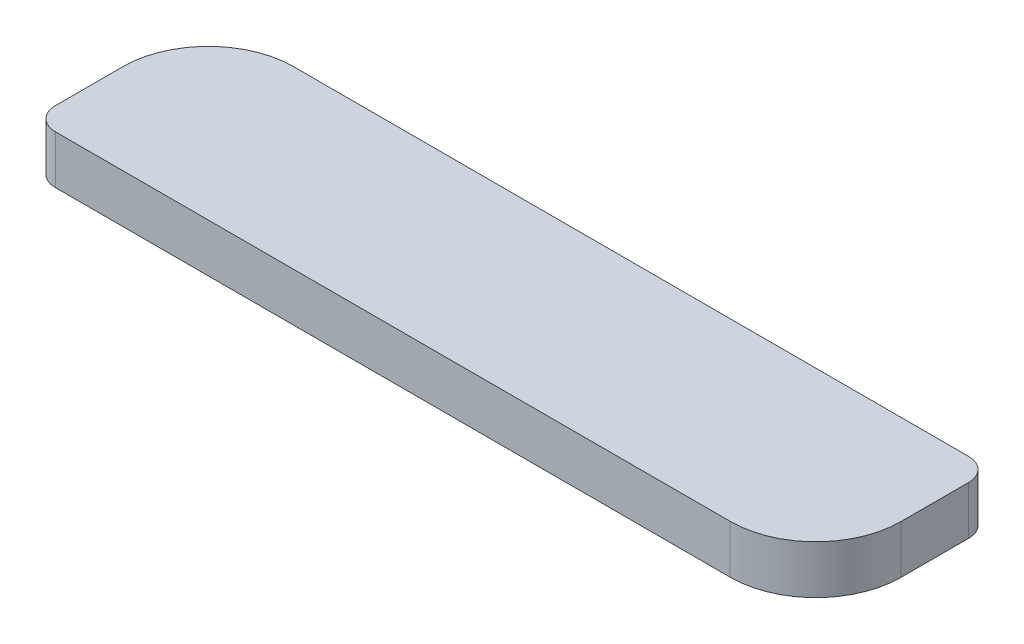
ISO-10303-21;
HEADER;
FILE_DESCRIPTION(('STEP AP214'),'2;1');
FILE_NAME('part.step','',(''),(''),'','','');
FILE_SCHEMA(('AUTOMOTIVE_DESIGN { 1 0 10303 214 1 1 1 1 }'));
ENDSEC;
DATA;
#1=APPLICATION_CONTEXT('core data for automotive mechanical design processes');
#2=APPLICATION_PROTOCOL_DEFINITION('international standard','automotive_design',2000,#1);
#3=PRODUCT_CONTEXT('',#1,'mechanical');
#4=PRODUCT('Part','Part','',(#3));
#5=PRODUCT_RELATED_PRODUCT_CATEGORY('part','',(#4));
#6=PRODUCT_DEFINITION_FORMATION('','',#4);
#7=PRODUCT_DEFINITION_CONTEXT('part definition',#1,'design');
#8=PRODUCT_DEFINITION('design','',#6,#7);
#9=PRODUCT_DEFINITION_SHAPE('','',#8);
#10=(LENGTH_UNIT() NAMED_UNIT(*) SI_UNIT(.MILLI.,.METRE.));
#11=(NAMED_UNIT(*) PLANE_ANGLE_UNIT() SI_UNIT($,.RADIAN.));
#12=(NAMED_UNIT(*) SI_UNIT($,.STERADIAN.) SOLID_ANGLE_UNIT());
#13=UNCERTAINTY_MEASURE_WITH_UNIT(LENGTH_MEASURE(1.E-05),#10,'distance_accuracy_value','');
#14=(GEOMETRIC_REPRESENTATION_CONTEXT(3) GLOBAL_UNCERTAINTY_ASSIGNED_CONTEXT((#13)) GLOBAL_UNIT_ASSIGNED_CONTEXT((#10,
#11,#12)) REPRESENTATION_CONTEXT('',''));
#15=CARTESIAN_POINT('',(0.,0.,0.));
#16=DIRECTION('',(0.,0.,1.));
#17=DIRECTION('',(1.,0.,0.));
#18=AXIS2_PLACEMENT_3D('',#15,#16,#17);
#19=CARTESIAN_POINT('',(0.,0.,-10.));
#20=DIRECTION('',(0.,-1.,0.));
#21=DIRECTION('',(0.,0.,-1.));
#22=AXIS2_PLACEMENT_3D('',#19,#20,#21);
#23=PLANE('',#22);
#24=CARTESIAN_POINT('',(28.,0.,-40.));
#25=DIRECTION('',(0.,1.,0.));
#26=DIRECTION('',(0.,0.,1.));
#27=AXIS2_PLACEMENT_3D('',#24,#25,#26);
#28=CIRCLE('',#27,38.);
#29=CARTESIAN_POINT('',(28.,0.,-78.));
#30=VERTEX_POINT('',#29);
#31=CARTESIAN_POINT('',(-10.,0.,-40.));
#32=VERTEX_POINT('',#31);
#33=EDGE_CURVE('E278',#30,#32,#28,.T.);
#34=ORIENTED_EDGE('',*,*,#33,.F.);
#35=DIRECTION('',(0.,0.,1.));
#36=VECTOR('',#35,1.);
#37=CARTESIAN_POINT('',(28.,0.,-78.));
#38=LINE('',#37,#36);
#39=CARTESIAN_POINT('',(28.,0.,-42.));
#40=VERTEX_POINT('',#39);
#41=EDGE_CURVE('E55',#30,#40,#38,.T.);
#42=ORIENTED_EDGE('',*,*,#41,.T.);
#43=DIRECTION('',(-1.,0.,0.));
#44=VECTOR('',#43,1.);
#45=CARTESIAN_POINT('',(294.,0.,-42.));
#46=LINE('',#45,#44);
#47=CARTESIAN_POINT('',(294.,0.,-42.));
#48=VERTEX_POINT('',#47);
#49=EDGE_CURVE('E148',#48,#40,#46,.T.);
#50=ORIENTED_EDGE('',*,*,#49,.F.);
#51=DIRECTION('',(0.,0.,1.));
#52=VECTOR('',#51,1.);
#53=CARTESIAN_POINT('',(294.,0.,-78.));
#54=LINE('',#53,#52);
#55=CARTESIAN_POINT('',(294.,0.,-78.));
#56=VERTEX_POINT('',#55);
#57=EDGE_CURVE('E61',#56,#48,#54,.T.);
#58=ORIENTED_EDGE('',*,*,#57,.F.);
#59=DIRECTION('',(-1.,0.,0.));
#60=VECTOR('',#59,1.);
#61=CARTESIAN_POINT('',(328.,0.,-78.));
#62=LINE('',#61,#60);
#63=CARTESIAN_POINT('',(328.,0.,-78.));
#64=VERTEX_POINT('',#63);
#65=EDGE_CURVE('E275',#64,#56,#62,.T.);
#66=ORIENTED_EDGE('',*,*,#65,.F.);
#67=CARTESIAN_POINT('',(328.,0.,-68.));
#68=DIRECTION('',(0.,1.,0.));
#69=DIRECTION('',(0.,0.,1.));
#70=AXIS2_PLACEMENT_3D('',#67,#68,#69);
#71=CIRCLE('',#70,10.);
#72=CARTESIAN_POINT('',(338.,0.,-68.));
#73=VERTEX_POINT('',#72);
#74=EDGE_CURVE('E272',#73,#64,#71,.T.);
#75=ORIENTED_EDGE('',*,*,#74,.F.);
#76=DIRECTION('',(0.,0.,-1.));
#77=VECTOR('',#76,1.);
#78=CARTESIAN_POINT('',(338.,0.,-38.));
#79=LINE('',#78,#77);
#80=CARTESIAN_POINT('',(338.,0.,-38.));
#81=VERTEX_POINT('',#80);
#82=EDGE_CURVE('E269',#81,#73,#79,.T.);
#83=ORIENTED_EDGE('',*,*,#82,.F.);
#84=CARTESIAN_POINT('',(300.,0.,-38.));
#85=DIRECTION('',(0.,1.,0.));
#86=DIRECTION('',(0.,0.,1.));
#87=AXIS2_PLACEMENT_3D('',#84,#85,#86);
#88=CIRCLE('',#87,38.);
#89=CARTESIAN_POINT('',(300.,0.,0.));
#90=VERTEX_POINT('',#89);
#91=EDGE_CURVE('E266',#90,#81,#88,.T.);
#92=ORIENTED_EDGE('',*,*,#91,.F.);
#93=DIRECTION('',(1.,0.,0.));
#94=VECTOR('',#93,1.);
#95=CARTESIAN_POINT('',(0.,0.,0.));
#96=LINE('',#95,#94);
#97=CARTESIAN_POINT('',(0.,0.,0.));
#98=VERTEX_POINT('',#97);
#99=EDGE_CURVE('E263',#98,#90,#96,.T.);
#100=ORIENTED_EDGE('',*,*,#99,.F.);
#101=CARTESIAN_POINT('',(0.,0.,-10.));
#102=DIRECTION('',(0.,1.,0.));
#103=DIRECTION('',(0.,0.,-1.));
#104=AXIS2_PLACEMENT_3D('',#101,#102,#103);
#105=CIRCLE('',#104,10.);
#106=CARTESIAN_POINT('',(-10.,0.,-10.));
#107=VERTEX_POINT('',#106);
#108=EDGE_CURVE('E153',#107,#98,#105,.T.);
#109=ORIENTED_EDGE('',*,*,#108,.F.);
#110=DIRECTION('',(0.,0.,1.));
#111=VECTOR('',#110,1.);
#112=CARTESIAN_POINT('',(-10.,0.,-40.));
#113=LINE('',#112,#111);
#114=EDGE_CURVE('E238',#32,#107,#113,.T.);
#115=ORIENTED_EDGE('',*,*,#114,.F.);
#116=EDGE_LOOP('',(#34,#42,#50,#58,#66,#75,#83,#92,#100,#109,#115));
#117=FACE_BOUND('',#116,.T.);
#118=ADVANCED_FACE('F39',(#117),#23,.T.);
#119=CARTESIAN_POINT('',(0.,21.5,-10.));
#120=DIRECTION('',(0.,-1.,0.));
#121=DIRECTION('',(0.,0.,-1.));
#122=AXIS2_PLACEMENT_3D('',#119,#120,#121);
#123=CYLINDRICAL_SURFACE('',#122,10.);
#124=ORIENTED_EDGE('',*,*,#108,.T.);
#125=DIRECTION('',(0.,-1.,0.));
#126=VECTOR('',#125,1.);
#127=CARTESIAN_POINT('',(0.,21.5,0.));
#128=LINE('',#127,#126);
#129=CARTESIAN_POINT('',(0.,21.5,0.));
#130=VERTEX_POINT('',#129);
#131=EDGE_CURVE('E11',#130,#98,#128,.T.);
#132=ORIENTED_EDGE('',*,*,#131,.F.);
#133=CARTESIAN_POINT('',(0.,21.5,-10.));
#134=DIRECTION('',(0.,1.,0.));
#135=DIRECTION('',(0.,0.,-1.));
#136=AXIS2_PLACEMENT_3D('',#133,#134,#135);
#137=CIRCLE('',#136,10.);
#138=CARTESIAN_POINT('',(-10.,21.5,-10.));
#139=VERTEX_POINT('',#138);
#140=EDGE_CURVE('E233',#139,#130,#137,.T.);
#141=ORIENTED_EDGE('',*,*,#140,.F.);
#142=DIRECTION('',(0.,-1.,0.));
#143=VECTOR('',#142,1.);
#144=CARTESIAN_POINT('',(-10.,21.5,-10.));
#145=LINE('',#144,#143);
#146=EDGE_CURVE('E259',#139,#107,#145,.T.);
#147=ORIENTED_EDGE('',*,*,#146,.T.);
#148=EDGE_LOOP('',(#124,#132,#141,#147));
#149=FACE_BOUND('',#148,.T.);
#150=ADVANCED_FACE('F41',(#149),#123,.T.);
#151=CARTESIAN_POINT('',(0.,21.5,0.));
#152=DIRECTION('',(0.,0.,-1.));
#153=DIRECTION('',(-1.,0.,0.));
#154=AXIS2_PLACEMENT_3D('',#151,#152,#153);
#155=PLANE('',#154);
#156=ORIENTED_EDGE('',*,*,#99,.T.);
#157=DIRECTION('',(0.,-1.,0.));
#158=VECTOR('',#157,1.);
#159=CARTESIAN_POINT('',(300.,21.5,0.));
#160=LINE('',#159,#158);
#161=CARTESIAN_POINT('',(300.,21.5,0.));
#162=VERTEX_POINT('',#161);
#163=EDGE_CURVE('E48',#162,#90,#160,.T.);
#164=ORIENTED_EDGE('',*,*,#163,.F.);
#165=DIRECTION('',(1.,0.,0.));
#166=VECTOR('',#165,1.);
#167=CARTESIAN_POINT('',(0.,21.5,0.));
#168=LINE('',#167,#166);
#169=EDGE_CURVE('E237',#130,#162,#168,.T.);
#170=ORIENTED_EDGE('',*,*,#169,.F.);
#171=ORIENTED_EDGE('',*,*,#131,.T.);
#172=EDGE_LOOP('',(#156,#164,#170,#171));
#173=FACE_BOUND('',#172,.T.);
#174=ADVANCED_FACE('F330',(#173),#155,.F.);
#175=CARTESIAN_POINT('',(300.,21.5,-38.));
#176=DIRECTION('',(0.,-1.,0.));
#177=DIRECTION('',(0.,0.,-1.));
#178=AXIS2_PLACEMENT_3D('',#175,#176,#177);
#179=CYLINDRICAL_SURFACE('',#178,38.);
#180=ORIENTED_EDGE('',*,*,#91,.T.);
#181=DIRECTION('',(0.,-1.,0.));
#182=VECTOR('',#181,1.);
#183=CARTESIAN_POINT('',(338.,21.5,-38.));
#184=LINE('',#183,#182);
#185=CARTESIAN_POINT('',(338.,21.5,-38.));
#186=VERTEX_POINT('',#185);
#187=EDGE_CURVE('E301',#186,#81,#184,.T.);
#188=ORIENTED_EDGE('',*,*,#187,.F.);
#189=CARTESIAN_POINT('',(300.,21.5,-38.));
#190=DIRECTION('',(0.,1.,0.));
#191=DIRECTION('',(0.,0.,1.));
#192=AXIS2_PLACEMENT_3D('',#189,#190,#191);
#193=CIRCLE('',#192,38.);
#194=EDGE_CURVE('E241',#162,#186,#193,.T.);
#195=ORIENTED_EDGE('',*,*,#194,.F.);
#196=ORIENTED_EDGE('',*,*,#163,.T.);
#197=EDGE_LOOP('',(#180,#188,#195,#196));
#198=FACE_BOUND('',#197,.T.);
#199=ADVANCED_FACE('F310',(#198),#179,.T.);
#200=CARTESIAN_POINT('',(338.,21.5,-38.));
#201=DIRECTION('',(-1.,0.,0.));
#202=DIRECTION('',(0.,0.,1.));
#203=AXIS2_PLACEMENT_3D('',#200,#201,#202);
#204=PLANE('',#203);
#205=ORIENTED_EDGE('',*,*,#82,.T.);
#206=DIRECTION('',(0.,-1.,0.));
#207=VECTOR('',#206,1.);
#208=CARTESIAN_POINT('',(338.,21.5,-68.));
#209=LINE('',#208,#207);
#210=CARTESIAN_POINT('',(338.,21.5,-68.));
#211=VERTEX_POINT('',#210);
#212=EDGE_CURVE('E297',#211,#73,#209,.T.);
#213=ORIENTED_EDGE('',*,*,#212,.F.);
#214=DIRECTION('',(0.,0.,-1.));
#215=VECTOR('',#214,1.);
#216=CARTESIAN_POINT('',(338.,21.5,-38.));
#217=LINE('',#216,#215);
#218=EDGE_CURVE('E244',#186,#211,#217,.T.);
#219=ORIENTED_EDGE('',*,*,#218,.F.);
#220=ORIENTED_EDGE('',*,*,#187,.T.);
#221=EDGE_LOOP('',(#205,#213,#219,#220));
#222=FACE_BOUND('',#221,.T.);
#223=ADVANCED_FACE('F318',(#222),#204,.F.);
#224=CARTESIAN_POINT('',(328.,21.5,-68.));
#225=DIRECTION('',(0.,-1.,0.));
#226=DIRECTION('',(0.,0.,-1.));
#227=AXIS2_PLACEMENT_3D('',#224,#225,#226);
#228=CYLINDRICAL_SURFACE('',#227,10.);
#229=ORIENTED_EDGE('',*,*,#74,.T.);
#230=DIRECTION('',(0.,-1.,0.));
#231=VECTOR('',#230,1.);
#232=CARTESIAN_POINT('',(328.,21.5,-78.));
#233=LINE('',#232,#231);
#234=CARTESIAN_POINT('',(328.,21.5,-78.));
#235=VERTEX_POINT('',#234);
#236=EDGE_CURVE('E293',#235,#64,#233,.T.);
#237=ORIENTED_EDGE('',*,*,#236,.F.);
#238=CARTESIAN_POINT('',(328.,21.5,-68.));
#239=DIRECTION('',(0.,1.,0.));
#240=DIRECTION('',(0.,0.,1.));
#241=AXIS2_PLACEMENT_3D('',#238,#239,#240);
#242=CIRCLE('',#241,10.);
#243=EDGE_CURVE('E247',#211,#235,#242,.T.);
#244=ORIENTED_EDGE('',*,*,#243,.F.);
#245=ORIENTED_EDGE('',*,*,#212,.T.);
#246=EDGE_LOOP('',(#229,#237,#244,#245));
#247=FACE_BOUND('',#246,.T.);
#248=ADVANCED_FACE('F322',(#247),#228,.T.);
#249=CARTESIAN_POINT('',(328.,21.5,-78.));
#250=DIRECTION('',(0.,0.,1.));
#251=DIRECTION('',(1.,0.,0.));
#252=AXIS2_PLACEMENT_3D('',#249,#250,#251);
#253=PLANE('',#252);
#254=ORIENTED_EDGE('',*,*,#65,.T.);
#255=DIRECTION('',(0.,1.,0.));
#256=VECTOR('',#255,1.);
#257=CARTESIAN_POINT('',(294.,0.,-78.));
#258=LINE('',#257,#256);
#259=CARTESIAN_POINT('',(294.,-8.17,-78.));
#260=VERTEX_POINT('',#259);
#261=EDGE_CURVE('E162',#260,#56,#258,.T.);
#262=ORIENTED_EDGE('',*,*,#261,.F.);
#263=DIRECTION('',(-1.,0.,0.));
#264=VECTOR('',#263,1.);
#265=CARTESIAN_POINT('',(294.,-8.17,-78.));
#266=LINE('',#265,#264);
#267=CARTESIAN_POINT('',(28.,-8.17,-78.));
#268=VERTEX_POINT('',#267);
#269=EDGE_CURVE('E187',#260,#268,#266,.T.);
#270=ORIENTED_EDGE('',*,*,#269,.T.);
#271=DIRECTION('',(0.,1.,0.));
#272=VECTOR('',#271,1.);
#273=CARTESIAN_POINT('',(28.,0.,-78.));
#274=LINE('',#273,#272);
#275=EDGE_CURVE('E188',#268,#30,#274,.T.);
#276=ORIENTED_EDGE('',*,*,#275,.T.);
#277=DIRECTION('',(0.,-1.,0.));
#278=VECTOR('',#277,1.);
#279=CARTESIAN_POINT('',(28.,21.5,-78.));
#280=LINE('',#279,#278);
#281=CARTESIAN_POINT('',(28.,21.5,-78.));
#282=VERTEX_POINT('',#281);
#283=EDGE_CURVE('E290',#282,#30,#280,.T.);
#284=ORIENTED_EDGE('',*,*,#283,.F.);
#285=DIRECTION('',(-1.,0.,0.));
#286=VECTOR('',#285,1.);
#287=CARTESIAN_POINT('',(328.,21.5,-78.));
#288=LINE('',#287,#286);
#289=EDGE_CURVE('E250',#235,#282,#288,.T.);
#290=ORIENTED_EDGE('',*,*,#289,.F.);
#291=ORIENTED_EDGE('',*,*,#236,.T.);
#292=EDGE_LOOP('',(#254,#262,#270,#276,#284,#290,#291));
#293=FACE_BOUND('',#292,.T.);
#294=ADVANCED_FACE('F342',(#293),#253,.F.);
#295=CARTESIAN_POINT('',(28.,21.5,-40.));
#296=DIRECTION('',(0.,-1.,0.));
#297=DIRECTION('',(0.,0.,-1.));
#298=AXIS2_PLACEMENT_3D('',#295,#296,#297);
#299=CYLINDRICAL_SURFACE('',#298,38.);
#300=ORIENTED_EDGE('',*,*,#33,.T.);
#301=DIRECTION('',(0.,-1.,0.));
#302=VECTOR('',#301,1.);
#303=CARTESIAN_POINT('',(-10.,21.5,-40.));
#304=LINE('',#303,#302);
#305=CARTESIAN_POINT('',(-10.,21.5,-40.));
#306=VERTEX_POINT('',#305);
#307=EDGE_CURVE('E286',#306,#32,#304,.T.);
#308=ORIENTED_EDGE('',*,*,#307,.F.);
#309=CARTESIAN_POINT('',(28.,21.5,-40.));
#310=DIRECTION('',(0.,1.,0.));
#311=DIRECTION('',(0.,0.,1.));
#312=AXIS2_PLACEMENT_3D('',#309,#310,#311);
#313=CIRCLE('',#312,38.);
#314=EDGE_CURVE('E253',#282,#306,#313,.T.);
#315=ORIENTED_EDGE('',*,*,#314,.F.);
#316=ORIENTED_EDGE('',*,*,#283,.T.);
#317=EDGE_LOOP('',(#300,#308,#315,#316));
#318=FACE_BOUND('',#317,.T.);
#319=ADVANCED_FACE('F340',(#318),#299,.T.);
#320=CARTESIAN_POINT('',(-10.,21.5,-40.));
#321=DIRECTION('',(1.,0.,0.));
#322=DIRECTION('',(0.,0.,-1.));
#323=AXIS2_PLACEMENT_3D('',#320,#321,#322);
#324=PLANE('',#323);
#325=ORIENTED_EDGE('',*,*,#114,.T.);
#326=ORIENTED_EDGE('',*,*,#146,.F.);
#327=DIRECTION('',(0.,0.,1.));
#328=VECTOR('',#327,1.);
#329=CARTESIAN_POINT('',(-10.,21.5,-40.));
#330=LINE('',#329,#328);
#331=EDGE_CURVE('E256',#306,#139,#330,.T.);
#332=ORIENTED_EDGE('',*,*,#331,.F.);
#333=ORIENTED_EDGE('',*,*,#307,.T.);
#334=EDGE_LOOP('',(#325,#326,#332,#333));
#335=FACE_BOUND('',#334,.T.);
#336=ADVANCED_FACE('F335',(#335),#324,.F.);
#337=CARTESIAN_POINT('',(0.,21.5,-10.));
#338=DIRECTION('',(0.,-1.,0.));
#339=DIRECTION('',(0.,0.,-1.));
#340=AXIS2_PLACEMENT_3D('',#337,#338,#339);
#341=PLANE('',#340);
#342=ORIENTED_EDGE('',*,*,#140,.T.);
#343=ORIENTED_EDGE('',*,*,#169,.T.);
#344=ORIENTED_EDGE('',*,*,#194,.T.);
#345=ORIENTED_EDGE('',*,*,#218,.T.);
#346=ORIENTED_EDGE('',*,*,#243,.T.);
#347=ORIENTED_EDGE('',*,*,#289,.T.);
#348=ORIENTED_EDGE('',*,*,#314,.T.);
#349=ORIENTED_EDGE('',*,*,#331,.T.);
#350=EDGE_LOOP('',(#342,#343,#344,#345,#346,#347,#348,#349));
#351=FACE_BOUND('',#350,.T.);
#352=ADVANCED_FACE('F326',(#351),#341,.F.);
#353=CARTESIAN_POINT('',(294.,0.,-42.));
#354=DIRECTION('',(0.,0.,-1.));
#355=DIRECTION('',(0.,1.,0.));
#356=AXIS2_PLACEMENT_3D('',#353,#354,#355);
#357=PLANE('',#356);
#358=DIRECTION('',(0.,-1.,0.));
#359=VECTOR('',#358,1.);
#360=CARTESIAN_POINT('',(28.,0.,-42.));
#361=LINE('',#360,#359);
#362=CARTESIAN_POINT('',(28.,-8.17,-42.));
#363=VERTEX_POINT('',#362);
#364=EDGE_CURVE('E194',#40,#363,#361,.T.);
#365=ORIENTED_EDGE('',*,*,#364,.T.);
#366=DIRECTION('',(-1.,0.,0.));
#367=VECTOR('',#366,1.);
#368=CARTESIAN_POINT('',(294.,-8.17,-42.));
#369=LINE('',#368,#367);
#370=CARTESIAN_POINT('',(294.,-8.17,-42.));
#371=VERTEX_POINT('',#370);
#372=EDGE_CURVE('E154',#371,#363,#369,.T.);
#373=ORIENTED_EDGE('',*,*,#372,.F.);
#374=DIRECTION('',(0.,-1.,0.));
#375=VECTOR('',#374,1.);
#376=CARTESIAN_POINT('',(294.,0.,-42.));
#377=LINE('',#376,#375);
#378=EDGE_CURVE('E159',#48,#371,#377,.T.);
#379=ORIENTED_EDGE('',*,*,#378,.F.);
#380=ORIENTED_EDGE('',*,*,#49,.T.);
#381=EDGE_LOOP('',(#365,#373,#379,#380));
#382=FACE_BOUND('',#381,.T.);
#383=ADVANCED_FACE('F165',(#382),#357,.F.);
#384=CARTESIAN_POINT('',(294.,-8.17,-42.));
#385=DIRECTION('',(0.,0.707106781186548,-0.707106781186547));
#386=DIRECTION('',(0.,0.707106781186547,0.707106781186548));
#387=AXIS2_PLACEMENT_3D('',#384,#385,#386);
#388=PLANE('',#387);
#389=DIRECTION('',(0.,-0.707106781186547,-0.707106781186548));
#390=VECTOR('',#389,1.);
#391=CARTESIAN_POINT('',(28.,-8.17,-42.));
#392=LINE('',#391,#390);
#393=CARTESIAN_POINT('',(28.,-10.9984271247462,-44.8284271247462));
#394=VERTEX_POINT('',#393);
#395=EDGE_CURVE('E197',#363,#394,#392,.T.);
#396=ORIENTED_EDGE('',*,*,#395,.T.);
#397=DIRECTION('',(-1.,0.,0.));
#398=VECTOR('',#397,1.);
#399=CARTESIAN_POINT('',(294.,-10.9984271247462,-44.8284271247462));
#400=LINE('',#399,#398);
#401=CARTESIAN_POINT('',(294.,-10.9984271247462,-44.8284271247462));
#402=VERTEX_POINT('',#401);
#403=EDGE_CURVE('E227',#402,#394,#400,.T.);
#404=ORIENTED_EDGE('',*,*,#403,.F.);
#405=DIRECTION('',(0.,-0.707106781186547,-0.707106781186548));
#406=VECTOR('',#405,1.);
#407=CARTESIAN_POINT('',(294.,-8.17,-42.));
#408=LINE('',#407,#406);
#409=EDGE_CURVE('E169',#371,#402,#408,.T.);
#410=ORIENTED_EDGE('',*,*,#409,.F.);
#411=ORIENTED_EDGE('',*,*,#372,.T.);
#412=EDGE_LOOP('',(#396,#404,#410,#411));
#413=FACE_BOUND('',#412,.T.);
#414=ADVANCED_FACE('F352',(#413),#388,.F.);
#415=CARTESIAN_POINT('',(294.,-10.9984271247462,-44.8284271247462));
#416=DIRECTION('',(0.,1.,0.));
#417=DIRECTION('',(0.,0.,1.));
#418=AXIS2_PLACEMENT_3D('',#415,#416,#417);
#419=PLANE('',#418);
#420=DIRECTION('',(0.,0.,-1.));
#421=VECTOR('',#420,1.);
#422=CARTESIAN_POINT('',(28.,-10.9984271247462,-44.8284271247462));
#423=LINE('',#422,#421);
#424=CARTESIAN_POINT('',(28.,-10.9984271247462,-47.6584271247462));
#425=VERTEX_POINT('',#424);
#426=EDGE_CURVE('E200',#394,#425,#423,.T.);
#427=ORIENTED_EDGE('',*,*,#426,.T.);
#428=DIRECTION('',(-1.,0.,0.));
#429=VECTOR('',#428,1.);
#430=CARTESIAN_POINT('',(294.,-10.9984271247462,-47.6584271247462));
#431=LINE('',#430,#429);
#432=CARTESIAN_POINT('',(294.,-10.9984271247462,-47.6584271247462));
#433=VERTEX_POINT('',#432);
#434=EDGE_CURVE('E223',#433,#425,#431,.T.);
#435=ORIENTED_EDGE('',*,*,#434,.F.);
#436=DIRECTION('',(0.,0.,-1.));
#437=VECTOR('',#436,1.);
#438=CARTESIAN_POINT('',(294.,-10.9984271247462,-44.8284271247462));
#439=LINE('',#438,#437);
#440=EDGE_CURVE('E172',#402,#433,#439,.T.);
#441=ORIENTED_EDGE('',*,*,#440,.F.);
#442=ORIENTED_EDGE('',*,*,#403,.T.);
#443=EDGE_LOOP('',(#427,#435,#441,#442));
#444=FACE_BOUND('',#443,.T.);
#445=ADVANCED_FACE('F359',(#444),#419,.F.);
#446=CARTESIAN_POINT('',(294.,-12.9822564936183,-60.));
#447=DIRECTION('',(-1.,0.,0.));
#448=DIRECTION('',(0.,0.,1.));
#449=AXIS2_PLACEMENT_3D('',#446,#447,#448);
#450=CYLINDRICAL_SURFACE('',#449,12.5);
#451=CARTESIAN_POINT('',(28.,-12.9822564936183,-60.));
#452=DIRECTION('',(-1.,0.,0.));
#453=DIRECTION('',(0.,0.,1.));
#454=AXIS2_PLACEMENT_3D('',#451,#452,#453);
#455=CIRCLE('',#454,12.5);
#456=CARTESIAN_POINT('',(28.,-10.9984271247462,-72.3415728752538));
#457=VERTEX_POINT('',#456);
#458=EDGE_CURVE('E203',#425,#457,#455,.T.);
#459=ORIENTED_EDGE('',*,*,#458,.T.);
#460=DIRECTION('',(-1.,0.,0.));
#461=VECTOR('',#460,1.);
#462=CARTESIAN_POINT('',(294.,-10.9984271247462,-72.3415728752538));
#463=LINE('',#462,#461);
#464=CARTESIAN_POINT('',(294.,-10.9984271247462,-72.3415728752538));
#465=VERTEX_POINT('',#464);
#466=EDGE_CURVE('E219',#465,#457,#463,.T.);
#467=ORIENTED_EDGE('',*,*,#466,.F.);
#468=CARTESIAN_POINT('',(294.,-12.9822564936183,-60.));
#469=DIRECTION('',(-1.,0.,0.));
#470=DIRECTION('',(0.,0.,1.));
#471=AXIS2_PLACEMENT_3D('',#468,#469,#470);
#472=CIRCLE('',#471,12.5);
#473=EDGE_CURVE('E178',#433,#465,#472,.T.);
#474=ORIENTED_EDGE('',*,*,#473,.F.);
#475=ORIENTED_EDGE('',*,*,#434,.T.);
#476=EDGE_LOOP('',(#459,#467,#474,#475));
#477=FACE_BOUND('',#476,.T.);
#478=ADVANCED_FACE('F362',(#477),#450,.F.);
#479=CARTESIAN_POINT('',(294.,-10.9984271247462,-75.1715728752538));
#480=DIRECTION('',(0.,1.,0.));
#481=DIRECTION('',(0.,0.,1.));
#482=AXIS2_PLACEMENT_3D('',#479,#480,#481);
#483=PLANE('',#482);
#484=DIRECTION('',(0.,0.,-1.));
#485=VECTOR('',#484,1.);
#486=CARTESIAN_POINT('',(28.,-10.9984271247462,-75.1715728752538));
#487=LINE('',#486,#485);
#488=CARTESIAN_POINT('',(28.,-10.9984271247462,-75.1715728752538));
#489=VERTEX_POINT('',#488);
#490=EDGE_CURVE('E206',#457,#489,#487,.T.);
#491=ORIENTED_EDGE('',*,*,#490,.T.);
#492=DIRECTION('',(-1.,0.,0.));
#493=VECTOR('',#492,1.);
#494=CARTESIAN_POINT('',(294.,-10.9984271247462,-75.1715728752538));
#495=LINE('',#494,#493);
#496=CARTESIAN_POINT('',(294.,-10.9984271247462,-75.1715728752538));
#497=VERTEX_POINT('',#496);
#498=EDGE_CURVE('E215',#497,#489,#495,.T.);
#499=ORIENTED_EDGE('',*,*,#498,.F.);
#500=DIRECTION('',(0.,0.,-1.));
#501=VECTOR('',#500,1.);
#502=CARTESIAN_POINT('',(294.,-10.9984271247462,-75.1715728752538));
#503=LINE('',#502,#501);
#504=EDGE_CURVE('E181',#465,#497,#503,.T.);
#505=ORIENTED_EDGE('',*,*,#504,.F.);
#506=ORIENTED_EDGE('',*,*,#466,.T.);
#507=EDGE_LOOP('',(#491,#499,#505,#506));
#508=FACE_BOUND('',#507,.T.);
#509=ADVANCED_FACE('F366',(#508),#483,.F.);
#510=CARTESIAN_POINT('',(294.,-8.17,-78.));
#511=DIRECTION('',(0.,0.707106781186548,0.707106781186547));
#512=DIRECTION('',(0.,-0.707106781186547,0.707106781186548));
#513=AXIS2_PLACEMENT_3D('',#510,#511,#512);
#514=PLANE('',#513);
#515=DIRECTION('',(0.,0.707106781186547,-0.707106781186548));
#516=VECTOR('',#515,1.);
#517=CARTESIAN_POINT('',(28.,-8.17,-78.));
#518=LINE('',#517,#516);
#519=EDGE_CURVE('E209',#489,#268,#518,.T.);
#520=ORIENTED_EDGE('',*,*,#519,.T.);
#521=ORIENTED_EDGE('',*,*,#269,.F.);
#522=DIRECTION('',(0.,0.707106781186547,-0.707106781186548));
#523=VECTOR('',#522,1.);
#524=CARTESIAN_POINT('',(294.,-8.17,-78.));
#525=LINE('',#524,#523);
#526=EDGE_CURVE('E184',#497,#260,#525,.T.);
#527=ORIENTED_EDGE('',*,*,#526,.F.);
#528=ORIENTED_EDGE('',*,*,#498,.T.);
#529=EDGE_LOOP('',(#520,#521,#527,#528));
#530=FACE_BOUND('',#529,.T.);
#531=ADVANCED_FACE('F369',(#530),#514,.F.);
#532=CARTESIAN_POINT('',(294.,-12.9822564936183,-60.));
#533=DIRECTION('',(-1.,0.,0.));
#534=DIRECTION('',(0.,0.,1.));
#535=AXIS2_PLACEMENT_3D('',#532,#533,#534);
#536=PLANE('',#535);
#537=ORIENTED_EDGE('',*,*,#261,.T.);
#538=ORIENTED_EDGE('',*,*,#57,.T.);
#539=ORIENTED_EDGE('',*,*,#378,.T.);
#540=ORIENTED_EDGE('',*,*,#409,.T.);
#541=ORIENTED_EDGE('',*,*,#440,.T.);
#542=ORIENTED_EDGE('',*,*,#473,.T.);
#543=ORIENTED_EDGE('',*,*,#504,.T.);
#544=ORIENTED_EDGE('',*,*,#526,.T.);
#545=EDGE_LOOP('',(#537,#538,#539,#540,#541,#542,#543,#544));
#546=FACE_BOUND('',#545,.T.);
#547=ADVANCED_FACE('F158',(#546),#536,.F.);
#548=CARTESIAN_POINT('',(28.,-12.9822564936183,-60.));
#549=DIRECTION('',(-1.,0.,0.));
#550=DIRECTION('',(0.,0.,1.));
#551=AXIS2_PLACEMENT_3D('',#548,#549,#550);
#552=PLANE('',#551);
#553=ORIENTED_EDGE('',*,*,#275,.F.);
#554=ORIENTED_EDGE('',*,*,#519,.F.);
#555=ORIENTED_EDGE('',*,*,#490,.F.);
#556=ORIENTED_EDGE('',*,*,#458,.F.);
#557=ORIENTED_EDGE('',*,*,#426,.F.);
#558=ORIENTED_EDGE('',*,*,#395,.F.);
#559=ORIENTED_EDGE('',*,*,#364,.F.);
#560=ORIENTED_EDGE('',*,*,#41,.F.);
#561=EDGE_LOOP('',(#553,#554,#555,#556,#557,#558,#559,#560));
#562=FACE_BOUND('',#561,.T.);
#563=ADVANCED_FACE('F347',(#562),#552,.T.);
#564=CLOSED_SHELL('',(#118,#150,#174,#199,#223,#248,#294,#319,#336,#352,#383,#414,#445,#478,
#509,#531,#547,#563));
#565=MANIFOLD_SOLID_BREP('B2',#564);
#566=ADVANCED_BREP_SHAPE_REPRESENTATION('',(#18,#565),#14);
#567=SHAPE_DEFINITION_REPRESENTATION(#9,#566);
ENDSEC;
END-ISO-10303-21;
